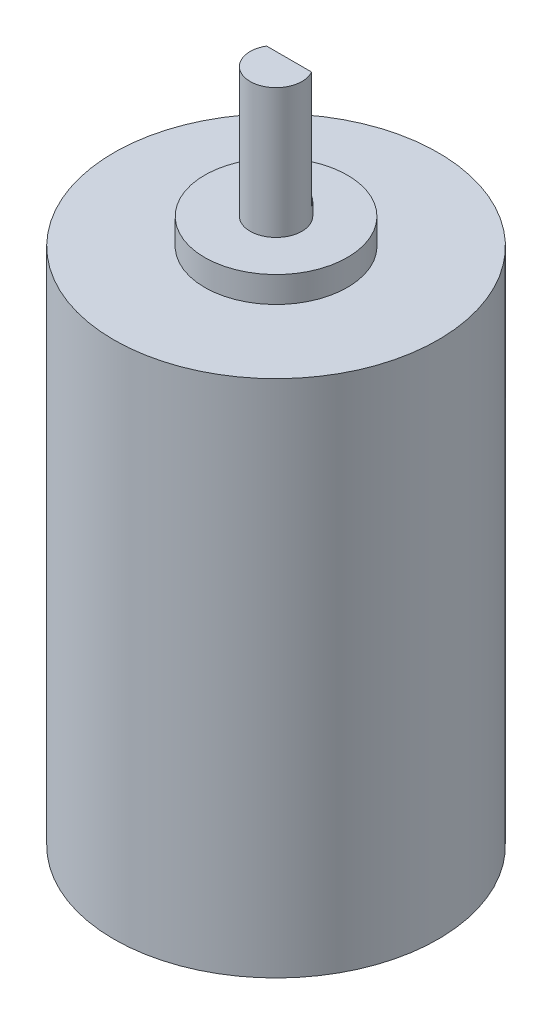
ISO-10303-21;
HEADER;
FILE_DESCRIPTION(('STEP AP214'),'2;1');
FILE_NAME('part.step','',(''),(''),'','','');
FILE_SCHEMA(('AUTOMOTIVE_DESIGN { 1 0 10303 214 1 1 1 1 }'));
ENDSEC;
DATA;
#1=APPLICATION_CONTEXT('core data for automotive mechanical design processes');
#2=APPLICATION_PROTOCOL_DEFINITION('international standard','automotive_design',2000,#1);
#3=PRODUCT_CONTEXT('',#1,'mechanical');
#4=PRODUCT('Part','Part','',(#3));
#5=PRODUCT_RELATED_PRODUCT_CATEGORY('part','',(#4));
#6=PRODUCT_DEFINITION_FORMATION('','',#4);
#7=PRODUCT_DEFINITION_CONTEXT('part definition',#1,'design');
#8=PRODUCT_DEFINITION('design','',#6,#7);
#9=PRODUCT_DEFINITION_SHAPE('','',#8);
#10=(LENGTH_UNIT() NAMED_UNIT(*) SI_UNIT(.MILLI.,.METRE.));
#11=(NAMED_UNIT(*) PLANE_ANGLE_UNIT() SI_UNIT($,.RADIAN.));
#12=(NAMED_UNIT(*) SI_UNIT($,.STERADIAN.) SOLID_ANGLE_UNIT());
#13=UNCERTAINTY_MEASURE_WITH_UNIT(LENGTH_MEASURE(1.E-05),#10,'distance_accuracy_value','');
#14=(GEOMETRIC_REPRESENTATION_CONTEXT(3) GLOBAL_UNCERTAINTY_ASSIGNED_CONTEXT((#13)) GLOBAL_UNIT_ASSIGNED_CONTEXT((#10,
#11,#12)) REPRESENTATION_CONTEXT('',''));
#15=CARTESIAN_POINT('',(0.,0.,0.));
#16=DIRECTION('',(0.,0.,1.));
#17=DIRECTION('',(1.,0.,0.));
#18=AXIS2_PLACEMENT_3D('',#15,#16,#17);
#19=CARTESIAN_POINT('',(0.,52.,0.));
#20=DIRECTION('',(0.,-1.,0.));
#21=DIRECTION('',(0.,0.,-1.));
#22=AXIS2_PLACEMENT_3D('',#19,#20,#21);
#23=PLANE('',#22);
#24=DIRECTION('',(-1.,0.,0.));
#25=VECTOR('',#24,1.);
#26=CARTESIAN_POINT('',(-1.73205080756888,52.,-0.999999999999999));
#27=LINE('',#26,#25);
#28=CARTESIAN_POINT('',(1.73205080756888,52.,-1.));
#29=VERTEX_POINT('',#28);
#30=CARTESIAN_POINT('',(-1.73205080756888,52.,-0.999999999999999));
#31=VERTEX_POINT('',#30);
#32=EDGE_CURVE('E59',#29,#31,#27,.T.);
#33=ORIENTED_EDGE('',*,*,#32,.T.);
#34=CARTESIAN_POINT('',(0.,52.,0.));
#35=DIRECTION('',(0.,1.,0.));
#36=DIRECTION('',(0.,0.,1.));
#37=AXIS2_PLACEMENT_3D('',#34,#35,#36);
#38=CIRCLE('',#37,2.);
#39=EDGE_CURVE('E52',#31,#29,#38,.T.);
#40=ORIENTED_EDGE('',*,*,#39,.T.);
#41=EDGE_LOOP('',(#33,#40));
#42=FACE_BOUND('',#41,.T.);
#43=ADVANCED_FACE('F45',(#42),#23,.F.);
#44=CARTESIAN_POINT('',(0.,52.,0.));
#45=DIRECTION('',(0.,1.,0.));
#46=DIRECTION('',(0.,0.,1.));
#47=AXIS2_PLACEMENT_3D('',#44,#45,#46);
#48=CYLINDRICAL_SURFACE('',#47,2.);
#49=CARTESIAN_POINT('',(0.,42.,0.));
#50=DIRECTION('',(0.,1.,0.));
#51=DIRECTION('',(0.,0.,1.));
#52=AXIS2_PLACEMENT_3D('',#49,#50,#51);
#53=CIRCLE('',#52,2.);
#54=CARTESIAN_POINT('',(0.,42.,2.));
#55=VERTEX_POINT('',#54);
#56=EDGE_CURVE('E82',#55,#55,#53,.T.);
#57=ORIENTED_EDGE('',*,*,#56,.T.);
#58=EDGE_LOOP('',(#57));
#59=FACE_BOUND('',#58,.T.);
#60=CARTESIAN_POINT('',(0.,43.,0.));
#61=DIRECTION('',(0.,1.,0.));
#62=DIRECTION('',(0.,0.,1.));
#63=AXIS2_PLACEMENT_3D('',#60,#61,#62);
#64=CIRCLE('',#63,2.);
#65=CARTESIAN_POINT('',(1.73205080756888,43.,-1.));
#66=VERTEX_POINT('',#65);
#67=CARTESIAN_POINT('',(-1.73205080756888,43.,-0.999999999999999));
#68=VERTEX_POINT('',#67);
#69=EDGE_CURVE('E12',#66,#68,#64,.T.);
#70=ORIENTED_EDGE('',*,*,#69,.F.);
#71=DIRECTION('',(0.,1.,0.));
#72=VECTOR('',#71,1.);
#73=CARTESIAN_POINT('',(1.73205080756888,43.,-1.));
#74=LINE('',#73,#72);
#75=EDGE_CURVE('E76',#66,#29,#74,.T.);
#76=ORIENTED_EDGE('',*,*,#75,.T.);
#77=ORIENTED_EDGE('',*,*,#39,.F.);
#78=DIRECTION('',(0.,1.,0.));
#79=VECTOR('',#78,1.);
#80=CARTESIAN_POINT('',(-1.73205080756888,43.,-0.999999999999999));
#81=LINE('',#80,#79);
#82=EDGE_CURVE('E70',#68,#31,#81,.T.);
#83=ORIENTED_EDGE('',*,*,#82,.F.);
#84=EDGE_LOOP('',(#70,#76,#77,#83));
#85=FACE_BOUND('',#84,.T.);
#86=ADVANCED_FACE('F81',(#59,#85),#48,.T.);
#87=CARTESIAN_POINT('',(5.5,42.,0.));
#88=DIRECTION('',(0.,-1.,0.));
#89=DIRECTION('',(0.,0.,-1.));
#90=AXIS2_PLACEMENT_3D('',#87,#88,#89);
#91=PLANE('',#90);
#92=ORIENTED_EDGE('',*,*,#56,.F.);
#93=EDGE_LOOP('',(#92));
#94=FACE_BOUND('',#93,.T.);
#95=CARTESIAN_POINT('',(0.,42.,0.));
#96=DIRECTION('',(0.,1.,0.));
#97=DIRECTION('',(0.,0.,1.));
#98=AXIS2_PLACEMENT_3D('',#95,#96,#97);
#99=CIRCLE('',#98,5.5);
#100=CARTESIAN_POINT('',(0.,42.,5.5));
#101=VERTEX_POINT('',#100);
#102=EDGE_CURVE('E84',#101,#101,#99,.T.);
#103=ORIENTED_EDGE('',*,*,#102,.T.);
#104=EDGE_LOOP('',(#103));
#105=FACE_BOUND('',#104,.T.);
#106=ADVANCED_FACE('F119',(#94,#105),#91,.F.);
#107=CARTESIAN_POINT('',(0.,52.,0.));
#108=DIRECTION('',(0.,1.,0.));
#109=DIRECTION('',(0.,0.,1.));
#110=AXIS2_PLACEMENT_3D('',#107,#108,#109);
#111=CYLINDRICAL_SURFACE('',#110,5.5);
#112=ORIENTED_EDGE('',*,*,#102,.F.);
#113=EDGE_LOOP('',(#112));
#114=FACE_BOUND('',#113,.T.);
#115=CARTESIAN_POINT('',(0.,40.,0.));
#116=DIRECTION('',(0.,1.,0.));
#117=DIRECTION('',(0.,0.,1.));
#118=AXIS2_PLACEMENT_3D('',#115,#116,#117);
#119=CIRCLE('',#118,5.5);
#120=CARTESIAN_POINT('',(0.,40.,5.5));
#121=VERTEX_POINT('',#120);
#122=EDGE_CURVE('E89',#121,#121,#119,.T.);
#123=ORIENTED_EDGE('',*,*,#122,.T.);
#124=EDGE_LOOP('',(#123));
#125=FACE_BOUND('',#124,.T.);
#126=ADVANCED_FACE('F125',(#114,#125),#111,.T.);
#127=CARTESIAN_POINT('',(12.5,40.,0.));
#128=DIRECTION('',(0.,-1.,0.));
#129=DIRECTION('',(0.,0.,-1.));
#130=AXIS2_PLACEMENT_3D('',#127,#128,#129);
#131=PLANE('',#130);
#132=ORIENTED_EDGE('',*,*,#122,.F.);
#133=EDGE_LOOP('',(#132));
#134=FACE_BOUND('',#133,.T.);
#135=CARTESIAN_POINT('',(0.,40.,0.));
#136=DIRECTION('',(0.,1.,0.));
#137=DIRECTION('',(0.,0.,1.));
#138=AXIS2_PLACEMENT_3D('',#135,#136,#137);
#139=CIRCLE('',#138,12.5);
#140=CARTESIAN_POINT('',(0.,40.,12.5));
#141=VERTEX_POINT('',#140);
#142=EDGE_CURVE('E92',#141,#141,#139,.T.);
#143=ORIENTED_EDGE('',*,*,#142,.T.);
#144=EDGE_LOOP('',(#143));
#145=FACE_BOUND('',#144,.T.);
#146=ADVANCED_FACE('F112',(#134,#145),#131,.F.);
#147=CARTESIAN_POINT('',(0.,52.,0.));
#148=DIRECTION('',(0.,1.,0.));
#149=DIRECTION('',(0.,0.,1.));
#150=AXIS2_PLACEMENT_3D('',#147,#148,#149);
#151=CYLINDRICAL_SURFACE('',#150,12.5);
#152=ORIENTED_EDGE('',*,*,#142,.F.);
#153=EDGE_LOOP('',(#152));
#154=FACE_BOUND('',#153,.T.);
#155=CARTESIAN_POINT('',(0.,0.,0.));
#156=DIRECTION('',(0.,1.,0.));
#157=DIRECTION('',(0.,0.,1.));
#158=AXIS2_PLACEMENT_3D('',#155,#156,#157);
#159=CIRCLE('',#158,12.5);
#160=CARTESIAN_POINT('',(0.,0.,12.5));
#161=VERTEX_POINT('',#160);
#162=EDGE_CURVE('E75',#161,#161,#159,.T.);
#163=ORIENTED_EDGE('',*,*,#162,.T.);
#164=EDGE_LOOP('',(#163));
#165=FACE_BOUND('',#164,.T.);
#166=ADVANCED_FACE('F100',(#154,#165),#151,.T.);
#167=CARTESIAN_POINT('',(0.,0.,0.));
#168=DIRECTION('',(0.,1.,0.));
#169=DIRECTION('',(0.,0.,1.));
#170=AXIS2_PLACEMENT_3D('',#167,#168,#169);
#171=PLANE('',#170);
#172=ORIENTED_EDGE('',*,*,#162,.F.);
#173=EDGE_LOOP('',(#172));
#174=FACE_BOUND('',#173,.T.);
#175=ADVANCED_FACE('F102',(#174),#171,.F.);
#176=CARTESIAN_POINT('',(0.,43.,0.));
#177=DIRECTION('',(0.,1.,0.));
#178=DIRECTION('',(0.,0.,1.));
#179=AXIS2_PLACEMENT_3D('',#176,#177,#178);
#180=PLANE('',#179);
#181=ORIENTED_EDGE('',*,*,#69,.T.);
#182=DIRECTION('',(-1.,0.,0.));
#183=VECTOR('',#182,1.);
#184=CARTESIAN_POINT('',(-1.73205080756888,43.,-0.999999999999999));
#185=LINE('',#184,#183);
#186=EDGE_CURVE('E72',#66,#68,#185,.T.);
#187=ORIENTED_EDGE('',*,*,#186,.F.);
#188=EDGE_LOOP('',(#181,#187));
#189=FACE_BOUND('',#188,.T.);
#190=ADVANCED_FACE('F104',(#189),#180,.T.);
#191=CARTESIAN_POINT('',(-1.73205080756888,43.,-0.999999999999999));
#192=DIRECTION('',(0.,0.,-1.));
#193=DIRECTION('',(-1.,0.,0.));
#194=AXIS2_PLACEMENT_3D('',#191,#192,#193);
#195=PLANE('',#194);
#196=ORIENTED_EDGE('',*,*,#32,.F.);
#197=ORIENTED_EDGE('',*,*,#75,.F.);
#198=ORIENTED_EDGE('',*,*,#186,.T.);
#199=ORIENTED_EDGE('',*,*,#82,.T.);
#200=EDGE_LOOP('',(#196,#197,#198,#199));
#201=FACE_BOUND('',#200,.T.);
#202=ADVANCED_FACE('F71',(#201),#195,.T.);
#203=CLOSED_SHELL('',(#43,#86,#106,#126,#146,#166,#175,#190,#202));
#204=MANIFOLD_SOLID_BREP('B2',#203);
#205=ADVANCED_BREP_SHAPE_REPRESENTATION('',(#18,#204),#14);
#206=SHAPE_DEFINITION_REPRESENTATION(#9,#205);
ENDSEC;
END-ISO-10303-21;
